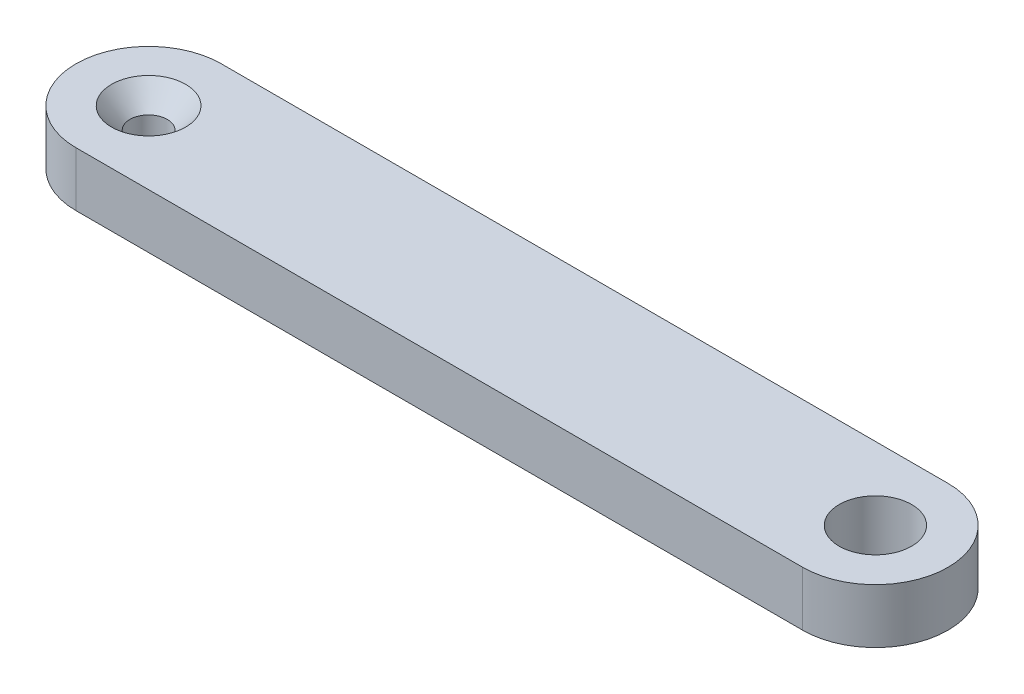
ISO-10303-21;
HEADER;
FILE_DESCRIPTION(('STEP AP214'),'2;1');
FILE_NAME('part.step','',(''),(''),'','','');
FILE_SCHEMA(('AUTOMOTIVE_DESIGN { 1 0 10303 214 1 1 1 1 }'));
ENDSEC;
DATA;
#1=APPLICATION_CONTEXT('core data for automotive mechanical design processes');
#2=APPLICATION_PROTOCOL_DEFINITION('international standard','automotive_design',2000,#1);
#3=PRODUCT_CONTEXT('',#1,'mechanical');
#4=PRODUCT('Part','Part','',(#3));
#5=PRODUCT_RELATED_PRODUCT_CATEGORY('part','',(#4));
#6=PRODUCT_DEFINITION_FORMATION('','',#4);
#7=PRODUCT_DEFINITION_CONTEXT('part definition',#1,'design');
#8=PRODUCT_DEFINITION('design','',#6,#7);
#9=PRODUCT_DEFINITION_SHAPE('','',#8);
#10=(LENGTH_UNIT() NAMED_UNIT(*) SI_UNIT(.MILLI.,.METRE.));
#11=(NAMED_UNIT(*) PLANE_ANGLE_UNIT() SI_UNIT($,.RADIAN.));
#12=(NAMED_UNIT(*) SI_UNIT($,.STERADIAN.) SOLID_ANGLE_UNIT());
#13=UNCERTAINTY_MEASURE_WITH_UNIT(LENGTH_MEASURE(1.E-05),#10,'distance_accuracy_value','');
#14=(GEOMETRIC_REPRESENTATION_CONTEXT(3) GLOBAL_UNCERTAINTY_ASSIGNED_CONTEXT((#13)) GLOBAL_UNIT_ASSIGNED_CONTEXT((#10,
#11,#12)) REPRESENTATION_CONTEXT('',''));
#15=CARTESIAN_POINT('',(0.,0.,0.));
#16=DIRECTION('',(0.,0.,1.));
#17=DIRECTION('',(1.,0.,0.));
#18=AXIS2_PLACEMENT_3D('',#15,#16,#17);
#19=CARTESIAN_POINT('',(0.,4.7625,6.35));
#20=DIRECTION('',(0.,0.,-1.));
#21=DIRECTION('',(-1.,0.,0.));
#22=AXIS2_PLACEMENT_3D('',#19,#20,#21);
#23=PLANE('',#22);
#24=DIRECTION('',(1.,0.,0.));
#25=VECTOR('',#24,1.);
#26=CARTESIAN_POINT('',(0.,0.,6.35));
#27=LINE('',#26,#25);
#28=CARTESIAN_POINT('',(-63.5,0.,6.35));
#29=VERTEX_POINT('',#28);
#30=CARTESIAN_POINT('',(0.,0.,6.35));
#31=VERTEX_POINT('',#30);
#32=EDGE_CURVE('E97',#29,#31,#27,.T.);
#33=ORIENTED_EDGE('',*,*,#32,.T.);
#34=DIRECTION('',(0.,-1.,0.));
#35=VECTOR('',#34,1.);
#36=CARTESIAN_POINT('',(0.,4.7625,6.35));
#37=LINE('',#36,#35);
#38=CARTESIAN_POINT('',(0.,4.7625,6.35));
#39=VERTEX_POINT('',#38);
#40=EDGE_CURVE('E11',#39,#31,#37,.T.);
#41=ORIENTED_EDGE('',*,*,#40,.F.);
#42=DIRECTION('',(1.,0.,0.));
#43=VECTOR('',#42,1.);
#44=CARTESIAN_POINT('',(0.,4.7625,6.35));
#45=LINE('',#44,#43);
#46=CARTESIAN_POINT('',(-63.5,4.7625,6.35));
#47=VERTEX_POINT('',#46);
#48=EDGE_CURVE('E82',#47,#39,#45,.T.);
#49=ORIENTED_EDGE('',*,*,#48,.F.);
#50=DIRECTION('',(0.,-1.,0.));
#51=VECTOR('',#50,1.);
#52=CARTESIAN_POINT('',(-63.5,4.7625,6.35));
#53=LINE('',#52,#51);
#54=EDGE_CURVE('E93',#47,#29,#53,.T.);
#55=ORIENTED_EDGE('',*,*,#54,.T.);
#56=EDGE_LOOP('',(#33,#41,#49,#55));
#57=FACE_BOUND('',#56,.T.);
#58=ADVANCED_FACE('F35',(#57),#23,.F.);
#59=CARTESIAN_POINT('',(0.,4.7625,0.));
#60=DIRECTION('',(0.,-1.,0.));
#61=DIRECTION('',(0.,0.,-1.));
#62=AXIS2_PLACEMENT_3D('',#59,#60,#61);
#63=CYLINDRICAL_SURFACE('',#62,6.35);
#64=CARTESIAN_POINT('',(0.,0.,0.));
#65=DIRECTION('',(0.,1.,0.));
#66=DIRECTION('',(0.,0.,1.));
#67=AXIS2_PLACEMENT_3D('',#64,#65,#66);
#68=CIRCLE('',#67,6.35);
#69=CARTESIAN_POINT('',(0.,0.,-6.35));
#70=VERTEX_POINT('',#69);
#71=EDGE_CURVE('E87',#31,#70,#68,.T.);
#72=ORIENTED_EDGE('',*,*,#71,.T.);
#73=DIRECTION('',(0.,-1.,0.));
#74=VECTOR('',#73,1.);
#75=CARTESIAN_POINT('',(0.,4.7625,-6.35));
#76=LINE('',#75,#74);
#77=CARTESIAN_POINT('',(0.,4.7625,-6.35));
#78=VERTEX_POINT('',#77);
#79=EDGE_CURVE('E43',#78,#70,#76,.T.);
#80=ORIENTED_EDGE('',*,*,#79,.F.);
#81=CARTESIAN_POINT('',(0.,4.7625,0.));
#82=DIRECTION('',(0.,1.,0.));
#83=DIRECTION('',(0.,0.,1.));
#84=AXIS2_PLACEMENT_3D('',#81,#82,#83);
#85=CIRCLE('',#84,6.35);
#86=EDGE_CURVE('E77',#39,#78,#85,.T.);
#87=ORIENTED_EDGE('',*,*,#86,.F.);
#88=ORIENTED_EDGE('',*,*,#40,.T.);
#89=EDGE_LOOP('',(#72,#80,#87,#88));
#90=FACE_BOUND('',#89,.T.);
#91=ADVANCED_FACE('F86',(#90),#63,.T.);
#92=CARTESIAN_POINT('',(0.,4.7625,-6.35));
#93=DIRECTION('',(0.,0.,-1.));
#94=DIRECTION('',(-1.,0.,0.));
#95=AXIS2_PLACEMENT_3D('',#92,#93,#94);
#96=PLANE('',#95);
#97=DIRECTION('',(1.,0.,0.));
#98=VECTOR('',#97,1.);
#99=CARTESIAN_POINT('',(0.,0.,-6.35));
#100=LINE('',#99,#98);
#101=CARTESIAN_POINT('',(-63.5,0.,-6.35));
#102=VERTEX_POINT('',#101);
#103=EDGE_CURVE('E102',#102,#70,#100,.T.);
#104=ORIENTED_EDGE('',*,*,#103,.F.);
#105=DIRECTION('',(0.,-1.,0.));
#106=VECTOR('',#105,1.);
#107=CARTESIAN_POINT('',(-63.5,4.7625,-6.35));
#108=LINE('',#107,#106);
#109=CARTESIAN_POINT('',(-63.5,4.7625,-6.35));
#110=VERTEX_POINT('',#109);
#111=EDGE_CURVE('E67',#110,#102,#108,.T.);
#112=ORIENTED_EDGE('',*,*,#111,.F.);
#113=DIRECTION('',(1.,0.,0.));
#114=VECTOR('',#113,1.);
#115=CARTESIAN_POINT('',(0.,4.7625,-6.35));
#116=LINE('',#115,#114);
#117=EDGE_CURVE('E80',#110,#78,#116,.T.);
#118=ORIENTED_EDGE('',*,*,#117,.T.);
#119=ORIENTED_EDGE('',*,*,#79,.T.);
#120=EDGE_LOOP('',(#104,#112,#118,#119));
#121=FACE_BOUND('',#120,.T.);
#122=ADVANCED_FACE('F91',(#121),#96,.T.);
#123=CARTESIAN_POINT('',(-63.5,4.7625,0.));
#124=DIRECTION('',(0.,-1.,0.));
#125=DIRECTION('',(0.,0.,-1.));
#126=AXIS2_PLACEMENT_3D('',#123,#124,#125);
#127=CYLINDRICAL_SURFACE('',#126,6.35);
#128=CARTESIAN_POINT('',(-63.5,0.,0.));
#129=DIRECTION('',(0.,1.,0.));
#130=DIRECTION('',(0.,0.,1.));
#131=AXIS2_PLACEMENT_3D('',#128,#129,#130);
#132=CIRCLE('',#131,6.35);
#133=EDGE_CURVE('E70',#102,#29,#132,.T.);
#134=ORIENTED_EDGE('',*,*,#133,.T.);
#135=ORIENTED_EDGE('',*,*,#54,.F.);
#136=CARTESIAN_POINT('',(-63.5,4.7625,0.));
#137=DIRECTION('',(0.,1.,0.));
#138=DIRECTION('',(0.,0.,1.));
#139=AXIS2_PLACEMENT_3D('',#136,#137,#138);
#140=CIRCLE('',#139,6.35);
#141=EDGE_CURVE('E51',#110,#47,#140,.T.);
#142=ORIENTED_EDGE('',*,*,#141,.F.);
#143=ORIENTED_EDGE('',*,*,#111,.T.);
#144=EDGE_LOOP('',(#134,#135,#142,#143));
#145=FACE_BOUND('',#144,.T.);
#146=ADVANCED_FACE('F121',(#145),#127,.T.);
#147=CARTESIAN_POINT('',(0.,4.7625,0.));
#148=DIRECTION('',(0.,1.,0.));
#149=DIRECTION('',(0.,0.,1.));
#150=AXIS2_PLACEMENT_3D('',#147,#148,#149);
#151=PLANE('',#150);
#152=CARTESIAN_POINT('',(-63.5,4.7625,0.));
#153=DIRECTION('',(0.,1.,0.));
#154=DIRECTION('',(0.,0.,1.));
#155=AXIS2_PLACEMENT_3D('',#152,#153,#154);
#156=CIRCLE('',#155,3.2385);
#157=CARTESIAN_POINT('',(-63.5,4.7625,3.2385));
#158=VERTEX_POINT('',#157);
#159=EDGE_CURVE('E180',#158,#158,#156,.T.);
#160=ORIENTED_EDGE('',*,*,#159,.F.);
#161=EDGE_LOOP('',(#160));
#162=FACE_BOUND('',#161,.T.);
#163=CARTESIAN_POINT('',(0.,4.7625,0.));
#164=DIRECTION('',(0.,1.,0.));
#165=DIRECTION('',(0.,0.,1.));
#166=AXIS2_PLACEMENT_3D('',#163,#164,#165);
#167=CIRCLE('',#166,3.1623);
#168=CARTESIAN_POINT('',(0.,4.7625,3.1623));
#169=VERTEX_POINT('',#168);
#170=EDGE_CURVE('E186',#169,#169,#167,.T.);
#171=ORIENTED_EDGE('',*,*,#170,.F.);
#172=EDGE_LOOP('',(#171));
#173=FACE_BOUND('',#172,.T.);
#174=ORIENTED_EDGE('',*,*,#48,.T.);
#175=ORIENTED_EDGE('',*,*,#86,.T.);
#176=ORIENTED_EDGE('',*,*,#117,.F.);
#177=ORIENTED_EDGE('',*,*,#141,.T.);
#178=EDGE_LOOP('',(#174,#175,#176,#177));
#179=FACE_BOUND('',#178,.T.);
#180=ADVANCED_FACE('F78',(#162,#173,#179),#151,.T.);
#181=CARTESIAN_POINT('',(0.,0.,0.));
#182=DIRECTION('',(0.,1.,0.));
#183=DIRECTION('',(0.,0.,1.));
#184=AXIS2_PLACEMENT_3D('',#181,#182,#183);
#185=PLANE('',#184);
#186=CARTESIAN_POINT('',(-63.5,0.,0.));
#187=DIRECTION('',(0.,1.,0.));
#188=DIRECTION('',(0.,0.,1.));
#189=AXIS2_PLACEMENT_3D('',#186,#187,#188);
#190=CIRCLE('',#189,1.63195);
#191=CARTESIAN_POINT('',(-63.5,0.,1.63195));
#192=VERTEX_POINT('',#191);
#193=EDGE_CURVE('E182',#192,#192,#190,.T.);
#194=ORIENTED_EDGE('',*,*,#193,.T.);
#195=EDGE_LOOP('',(#194));
#196=FACE_BOUND('',#195,.T.);
#197=CARTESIAN_POINT('',(0.,0.,0.));
#198=DIRECTION('',(0.,1.,0.));
#199=DIRECTION('',(0.,0.,1.));
#200=AXIS2_PLACEMENT_3D('',#197,#198,#199);
#201=CIRCLE('',#200,3.1623);
#202=CARTESIAN_POINT('',(0.,0.,3.1623));
#203=VERTEX_POINT('',#202);
#204=EDGE_CURVE('E100',#203,#203,#201,.T.);
#205=ORIENTED_EDGE('',*,*,#204,.T.);
#206=EDGE_LOOP('',(#205));
#207=FACE_BOUND('',#206,.T.);
#208=ORIENTED_EDGE('',*,*,#32,.F.);
#209=ORIENTED_EDGE('',*,*,#133,.F.);
#210=ORIENTED_EDGE('',*,*,#103,.T.);
#211=ORIENTED_EDGE('',*,*,#71,.F.);
#212=EDGE_LOOP('',(#208,#209,#210,#211));
#213=FACE_BOUND('',#212,.T.);
#214=ADVANCED_FACE('F109',(#196,#207,#213),#185,.F.);
#215=CARTESIAN_POINT('',(0.,0.,0.));
#216=DIRECTION('',(0.,1.,0.));
#217=DIRECTION('',(0.,0.,1.));
#218=AXIS2_PLACEMENT_3D('',#215,#216,#217);
#219=CYLINDRICAL_SURFACE('',#218,3.1623);
#220=ORIENTED_EDGE('',*,*,#204,.F.);
#221=EDGE_LOOP('',(#220));
#222=FACE_BOUND('',#221,.T.);
#223=ORIENTED_EDGE('',*,*,#170,.T.);
#224=EDGE_LOOP('',(#223));
#225=FACE_BOUND('',#224,.T.);
#226=ADVANCED_FACE('F111',(#222,#225),#219,.F.);
#227=CARTESIAN_POINT('',(-63.5,4.7625,0.));
#228=DIRECTION('',(0.,1.,0.));
#229=DIRECTION('',(0.,0.,1.));
#230=AXIS2_PLACEMENT_3D('',#227,#228,#229);
#231=CYLINDRICAL_SURFACE('',#230,1.63195);
#232=ORIENTED_EDGE('',*,*,#193,.F.);
#233=EDGE_LOOP('',(#232));
#234=FACE_BOUND('',#233,.T.);
#235=CARTESIAN_POINT('',(-63.5,2.91437563537909,0.));
#236=DIRECTION('',(0.,1.,0.));
#237=DIRECTION('',(0.,0.,1.));
#238=AXIS2_PLACEMENT_3D('',#235,#236,#237);
#239=CIRCLE('',#238,1.63195);
#240=CARTESIAN_POINT('',(-63.5,2.91437563537909,1.63195));
#241=VERTEX_POINT('',#240);
#242=EDGE_CURVE('E177',#241,#241,#239,.T.);
#243=ORIENTED_EDGE('',*,*,#242,.T.);
#244=EDGE_LOOP('',(#243));
#245=FACE_BOUND('',#244,.T.);
#246=ADVANCED_FACE('F118',(#234,#245),#231,.F.);
#247=CARTESIAN_POINT('',(-63.5,4.7625,0.));
#248=DIRECTION('',(0.,1.,0.));
#249=DIRECTION('',(0.,0.,1.));
#250=AXIS2_PLACEMENT_3D('',#247,#248,#249);
#251=CONICAL_SURFACE('',#250,3.2385,0.715584993317675);
#252=ORIENTED_EDGE('',*,*,#242,.F.);
#253=EDGE_LOOP('',(#252));
#254=FACE_BOUND('',#253,.T.);
#255=ORIENTED_EDGE('',*,*,#159,.T.);
#256=EDGE_LOOP('',(#255));
#257=FACE_BOUND('',#256,.T.);
#258=ADVANCED_FACE('F160',(#254,#257),#251,.F.);
#259=CLOSED_SHELL('',(#58,#91,#122,#146,#180,#214,#226,#246,#258));
#260=MANIFOLD_SOLID_BREP('B2',#259);
#261=ADVANCED_BREP_SHAPE_REPRESENTATION('',(#18,#260),#14);
#262=SHAPE_DEFINITION_REPRESENTATION(#9,#261);
ENDSEC;
END-ISO-10303-21;
